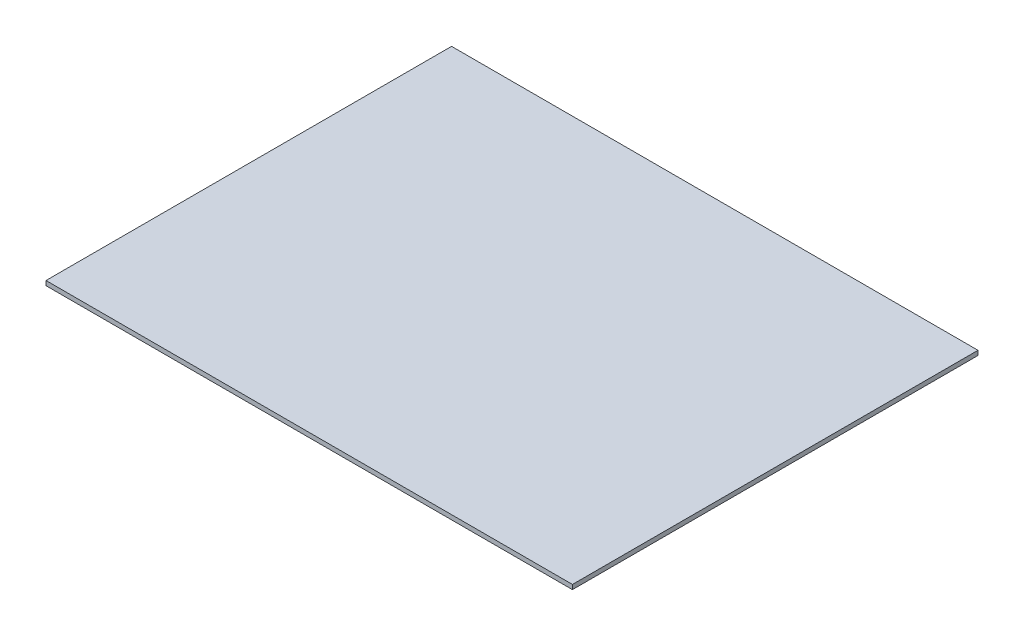
ISO-10303-21;
HEADER;
FILE_DESCRIPTION(('STEP AP214'),'2;1');
FILE_NAME('part.step','',(''),(''),'','','');
FILE_SCHEMA(('AUTOMOTIVE_DESIGN { 1 0 10303 214 1 1 1 1 }'));
ENDSEC;
DATA;
#1=APPLICATION_CONTEXT('core data for automotive mechanical design processes');
#2=APPLICATION_PROTOCOL_DEFINITION('international standard','automotive_design',2000,#1);
#3=PRODUCT_CONTEXT('',#1,'mechanical');
#4=PRODUCT('Part','Part','',(#3));
#5=PRODUCT_RELATED_PRODUCT_CATEGORY('part','',(#4));
#6=PRODUCT_DEFINITION_FORMATION('','',#4);
#7=PRODUCT_DEFINITION_CONTEXT('part definition',#1,'design');
#8=PRODUCT_DEFINITION('design','',#6,#7);
#9=PRODUCT_DEFINITION_SHAPE('','',#8);
#10=(LENGTH_UNIT() NAMED_UNIT(*) SI_UNIT(.MILLI.,.METRE.));
#11=(NAMED_UNIT(*) PLANE_ANGLE_UNIT() SI_UNIT($,.RADIAN.));
#12=(NAMED_UNIT(*) SI_UNIT($,.STERADIAN.) SOLID_ANGLE_UNIT());
#13=UNCERTAINTY_MEASURE_WITH_UNIT(LENGTH_MEASURE(1.E-05),#10,'distance_accuracy_value','');
#14=(GEOMETRIC_REPRESENTATION_CONTEXT(3) GLOBAL_UNCERTAINTY_ASSIGNED_CONTEXT((#13)) GLOBAL_UNIT_ASSIGNED_CONTEXT((#10,
#11,#12)) REPRESENTATION_CONTEXT('',''));
#15=CARTESIAN_POINT('',(0.,0.,0.));
#16=DIRECTION('',(0.,0.,1.));
#17=DIRECTION('',(1.,0.,0.));
#18=AXIS2_PLACEMENT_3D('',#15,#16,#17);
#19=CARTESIAN_POINT('',(233.,4.,179.5));
#20=DIRECTION('',(-1.,0.,0.));
#21=DIRECTION('',(0.,0.,1.));
#22=AXIS2_PLACEMENT_3D('',#19,#20,#21);
#23=PLANE('',#22);
#24=DIRECTION('',(0.,0.,-1.));
#25=VECTOR('',#24,1.);
#26=CARTESIAN_POINT('',(233.,0.,179.5));
#27=LINE('',#26,#25);
#28=CARTESIAN_POINT('',(233.,0.,179.5));
#29=VERTEX_POINT('',#28);
#30=CARTESIAN_POINT('',(233.,0.,-179.5));
#31=VERTEX_POINT('',#30);
#32=EDGE_CURVE('E99',#29,#31,#27,.T.);
#33=ORIENTED_EDGE('',*,*,#32,.T.);
#34=DIRECTION('',(0.,-1.,0.));
#35=VECTOR('',#34,1.);
#36=CARTESIAN_POINT('',(233.,4.,-179.5));
#37=LINE('',#36,#35);
#38=CARTESIAN_POINT('',(233.,4.,-179.5));
#39=VERTEX_POINT('',#38);
#40=EDGE_CURVE('E11',#39,#31,#37,.T.);
#41=ORIENTED_EDGE('',*,*,#40,.F.);
#42=DIRECTION('',(0.,0.,-1.));
#43=VECTOR('',#42,1.);
#44=CARTESIAN_POINT('',(233.,4.,179.5));
#45=LINE('',#44,#43);
#46=CARTESIAN_POINT('',(233.,4.,179.5));
#47=VERTEX_POINT('',#46);
#48=EDGE_CURVE('E87',#47,#39,#45,.T.);
#49=ORIENTED_EDGE('',*,*,#48,.F.);
#50=DIRECTION('',(0.,-1.,0.));
#51=VECTOR('',#50,1.);
#52=CARTESIAN_POINT('',(233.,4.,179.5));
#53=LINE('',#52,#51);
#54=EDGE_CURVE('E95',#47,#29,#53,.T.);
#55=ORIENTED_EDGE('',*,*,#54,.T.);
#56=EDGE_LOOP('',(#33,#41,#49,#55));
#57=FACE_BOUND('',#56,.T.);
#58=ADVANCED_FACE('F36',(#57),#23,.F.);
#59=CARTESIAN_POINT('',(-233.,4.,-179.5));
#60=DIRECTION('',(0.,0.,1.));
#61=DIRECTION('',(1.,0.,0.));
#62=AXIS2_PLACEMENT_3D('',#59,#60,#61);
#63=PLANE('',#62);
#64=DIRECTION('',(-1.,0.,0.));
#65=VECTOR('',#64,1.);
#66=CARTESIAN_POINT('',(-233.,0.,-179.5));
#67=LINE('',#66,#65);
#68=CARTESIAN_POINT('',(-233.,0.,-179.5));
#69=VERTEX_POINT('',#68);
#70=EDGE_CURVE('E91',#31,#69,#67,.T.);
#71=ORIENTED_EDGE('',*,*,#70,.T.);
#72=DIRECTION('',(0.,-1.,0.));
#73=VECTOR('',#72,1.);
#74=CARTESIAN_POINT('',(-233.,4.,-179.5));
#75=LINE('',#74,#73);
#76=CARTESIAN_POINT('',(-233.,4.,-179.5));
#77=VERTEX_POINT('',#76);
#78=EDGE_CURVE('E44',#77,#69,#75,.T.);
#79=ORIENTED_EDGE('',*,*,#78,.F.);
#80=DIRECTION('',(-1.,0.,0.));
#81=VECTOR('',#80,1.);
#82=CARTESIAN_POINT('',(-233.,4.,-179.5));
#83=LINE('',#82,#81);
#84=EDGE_CURVE('E82',#39,#77,#83,.T.);
#85=ORIENTED_EDGE('',*,*,#84,.F.);
#86=ORIENTED_EDGE('',*,*,#40,.T.);
#87=EDGE_LOOP('',(#71,#79,#85,#86));
#88=FACE_BOUND('',#87,.T.);
#89=ADVANCED_FACE('F90',(#88),#63,.F.);
#90=CARTESIAN_POINT('',(-233.,4.,179.5));
#91=DIRECTION('',(1.,0.,0.));
#92=DIRECTION('',(0.,0.,-1.));
#93=AXIS2_PLACEMENT_3D('',#90,#91,#92);
#94=PLANE('',#93);
#95=DIRECTION('',(0.,0.,1.));
#96=VECTOR('',#95,1.);
#97=CARTESIAN_POINT('',(-233.,0.,179.5));
#98=LINE('',#97,#96);
#99=CARTESIAN_POINT('',(-233.,0.,179.5));
#100=VERTEX_POINT('',#99);
#101=EDGE_CURVE('E69',#69,#100,#98,.T.);
#102=ORIENTED_EDGE('',*,*,#101,.T.);
#103=DIRECTION('',(0.,-1.,0.));
#104=VECTOR('',#103,1.);
#105=CARTESIAN_POINT('',(-233.,4.,179.5));
#106=LINE('',#105,#104);
#107=CARTESIAN_POINT('',(-233.,4.,179.5));
#108=VERTEX_POINT('',#107);
#109=EDGE_CURVE('E92',#108,#100,#106,.T.);
#110=ORIENTED_EDGE('',*,*,#109,.F.);
#111=DIRECTION('',(0.,0.,1.));
#112=VECTOR('',#111,1.);
#113=CARTESIAN_POINT('',(-233.,4.,179.5));
#114=LINE('',#113,#112);
#115=EDGE_CURVE('E85',#77,#108,#114,.T.);
#116=ORIENTED_EDGE('',*,*,#115,.F.);
#117=ORIENTED_EDGE('',*,*,#78,.T.);
#118=EDGE_LOOP('',(#102,#110,#116,#117));
#119=FACE_BOUND('',#118,.T.);
#120=ADVANCED_FACE('F93',(#119),#94,.F.);
#121=CARTESIAN_POINT('',(-233.,4.,179.5));
#122=DIRECTION('',(0.,0.,-1.));
#123=DIRECTION('',(-1.,0.,0.));
#124=AXIS2_PLACEMENT_3D('',#121,#122,#123);
#125=PLANE('',#124);
#126=DIRECTION('',(1.,0.,0.));
#127=VECTOR('',#126,1.);
#128=CARTESIAN_POINT('',(-233.,0.,179.5));
#129=LINE('',#128,#127);
#130=EDGE_CURVE('E75',#100,#29,#129,.T.);
#131=ORIENTED_EDGE('',*,*,#130,.T.);
#132=ORIENTED_EDGE('',*,*,#54,.F.);
#133=DIRECTION('',(1.,0.,0.));
#134=VECTOR('',#133,1.);
#135=CARTESIAN_POINT('',(-233.,4.,179.5));
#136=LINE('',#135,#134);
#137=EDGE_CURVE('E52',#108,#47,#136,.T.);
#138=ORIENTED_EDGE('',*,*,#137,.F.);
#139=ORIENTED_EDGE('',*,*,#109,.T.);
#140=EDGE_LOOP('',(#131,#132,#138,#139));
#141=FACE_BOUND('',#140,.T.);
#142=ADVANCED_FACE('F106',(#141),#125,.F.);
#143=CARTESIAN_POINT('',(0.,4.,0.));
#144=DIRECTION('',(0.,-1.,0.));
#145=DIRECTION('',(0.,0.,-1.));
#146=AXIS2_PLACEMENT_3D('',#143,#144,#145);
#147=PLANE('',#146);
#148=ORIENTED_EDGE('',*,*,#48,.T.);
#149=ORIENTED_EDGE('',*,*,#84,.T.);
#150=ORIENTED_EDGE('',*,*,#115,.T.);
#151=ORIENTED_EDGE('',*,*,#137,.T.);
#152=EDGE_LOOP('',(#148,#149,#150,#151));
#153=FACE_BOUND('',#152,.T.);
#154=ADVANCED_FACE('F83',(#153),#147,.F.);
#155=CARTESIAN_POINT('',(0.,0.,0.));
#156=DIRECTION('',(0.,-1.,0.));
#157=DIRECTION('',(0.,0.,-1.));
#158=AXIS2_PLACEMENT_3D('',#155,#156,#157);
#159=PLANE('',#158);
#160=ORIENTED_EDGE('',*,*,#32,.F.);
#161=ORIENTED_EDGE('',*,*,#130,.F.);
#162=ORIENTED_EDGE('',*,*,#101,.F.);
#163=ORIENTED_EDGE('',*,*,#70,.F.);
#164=EDGE_LOOP('',(#160,#161,#162,#163));
#165=FACE_BOUND('',#164,.T.);
#166=ADVANCED_FACE('F109',(#165),#159,.T.);
#167=CLOSED_SHELL('',(#58,#89,#120,#142,#154,#166));
#168=MANIFOLD_SOLID_BREP('B2',#167);
#169=ADVANCED_BREP_SHAPE_REPRESENTATION('',(#18,#168),#14);
#170=SHAPE_DEFINITION_REPRESENTATION(#9,#169);
ENDSEC;
END-ISO-10303-21;
